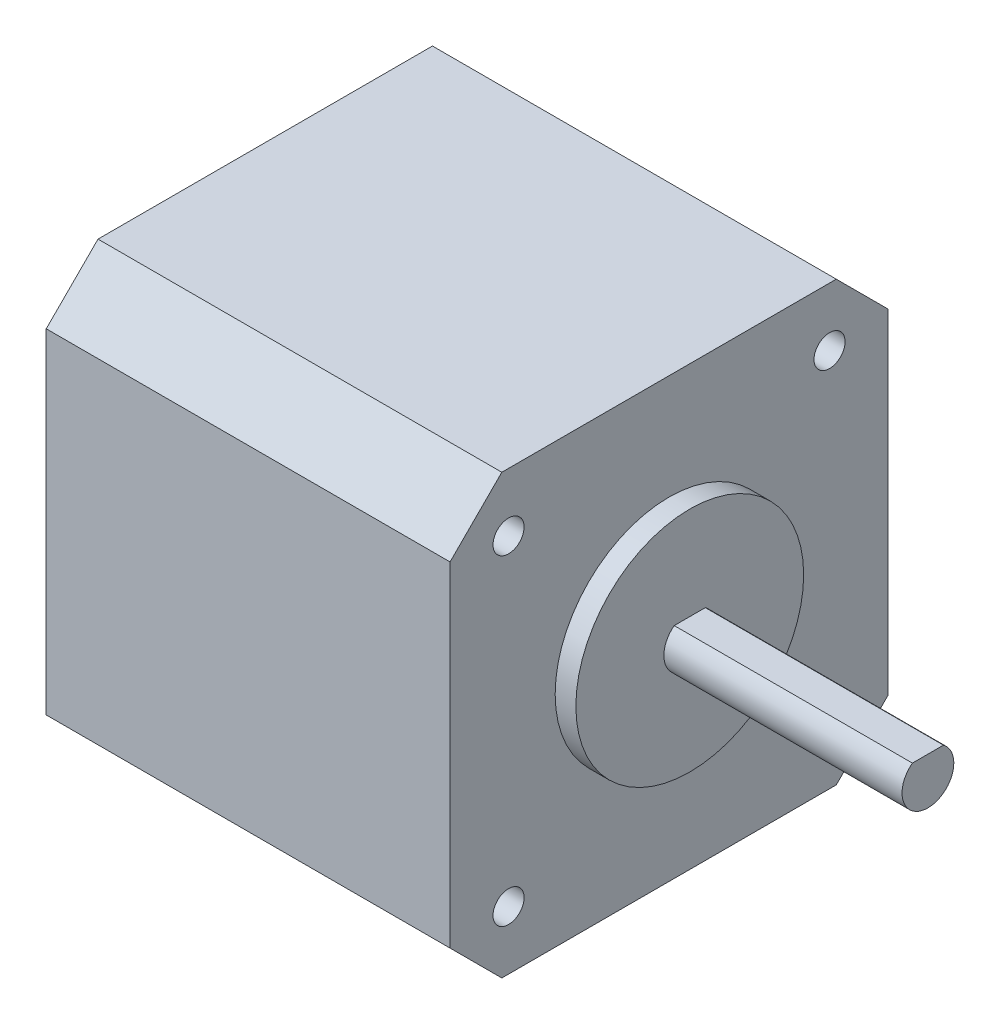
ISO-10303-21;
HEADER;
FILE_DESCRIPTION(('STEP AP214'),'2;1');
FILE_NAME('part.step','',(''),(''),'','','');
FILE_SCHEMA(('AUTOMOTIVE_DESIGN { 1 0 10303 214 1 1 1 1 }'));
ENDSEC;
DATA;
#1=APPLICATION_CONTEXT('core data for automotive mechanical design processes');
#2=APPLICATION_PROTOCOL_DEFINITION('international standard','automotive_design',2000,#1);
#3=PRODUCT_CONTEXT('',#1,'mechanical');
#4=PRODUCT('Part','Part','',(#3));
#5=PRODUCT_RELATED_PRODUCT_CATEGORY('part','',(#4));
#6=PRODUCT_DEFINITION_FORMATION('','',#4);
#7=PRODUCT_DEFINITION_CONTEXT('part definition',#1,'design');
#8=PRODUCT_DEFINITION('design','',#6,#7);
#9=PRODUCT_DEFINITION_SHAPE('','',#8);
#10=(LENGTH_UNIT() NAMED_UNIT(*) SI_UNIT(.MILLI.,.METRE.));
#11=(NAMED_UNIT(*) PLANE_ANGLE_UNIT() SI_UNIT($,.RADIAN.));
#12=(NAMED_UNIT(*) SI_UNIT($,.STERADIAN.) SOLID_ANGLE_UNIT());
#13=UNCERTAINTY_MEASURE_WITH_UNIT(LENGTH_MEASURE(1.E-05),#10,'distance_accuracy_value','');
#14=(GEOMETRIC_REPRESENTATION_CONTEXT(3) GLOBAL_UNCERTAINTY_ASSIGNED_CONTEXT((#13)) GLOBAL_UNIT_ASSIGNED_CONTEXT((#10,
#11,#12)) REPRESENTATION_CONTEXT('',''));
#15=CARTESIAN_POINT('',(0.,0.,0.));
#16=DIRECTION('',(0.,0.,1.));
#17=DIRECTION('',(1.,0.,0.));
#18=AXIS2_PLACEMENT_3D('',#15,#16,#17);
#19=CARTESIAN_POINT('',(39.,0.,-42.3));
#20=DIRECTION('',(0.,0.,1.));
#21=DIRECTION('',(1.,0.,0.));
#22=AXIS2_PLACEMENT_3D('',#19,#20,#21);
#23=PLANE('',#22);
#24=DIRECTION('',(0.,1.,0.));
#25=VECTOR('',#24,1.);
#26=CARTESIAN_POINT('',(0.,0.,-42.3));
#27=LINE('',#26,#25);
#28=CARTESIAN_POINT('',(0.,5.,-42.3));
#29=VERTEX_POINT('',#28);
#30=CARTESIAN_POINT('',(0.,37.3,-42.3));
#31=VERTEX_POINT('',#30);
#32=EDGE_CURVE('E172',#29,#31,#27,.T.);
#33=ORIENTED_EDGE('',*,*,#32,.T.);
#34=DIRECTION('',(-1.,0.,0.));
#35=VECTOR('',#34,1.);
#36=CARTESIAN_POINT('',(39.,37.3,-42.3));
#37=LINE('',#36,#35);
#38=CARTESIAN_POINT('',(39.,37.3,-42.3));
#39=VERTEX_POINT('',#38);
#40=EDGE_CURVE('E11',#39,#31,#37,.T.);
#41=ORIENTED_EDGE('',*,*,#40,.F.);
#42=DIRECTION('',(0.,1.,0.));
#43=VECTOR('',#42,1.);
#44=CARTESIAN_POINT('',(39.,0.,-42.3));
#45=LINE('',#44,#43);
#46=CARTESIAN_POINT('',(39.,5.,-42.3));
#47=VERTEX_POINT('',#46);
#48=EDGE_CURVE('E234',#47,#39,#45,.T.);
#49=ORIENTED_EDGE('',*,*,#48,.F.);
#50=DIRECTION('',(-1.,0.,0.));
#51=VECTOR('',#50,1.);
#52=CARTESIAN_POINT('',(39.,5.,-42.3));
#53=LINE('',#52,#51);
#54=EDGE_CURVE('E151',#47,#29,#53,.T.);
#55=ORIENTED_EDGE('',*,*,#54,.T.);
#56=EDGE_LOOP('',(#33,#41,#49,#55));
#57=FACE_BOUND('',#56,.T.);
#58=ADVANCED_FACE('F41',(#57),#23,.F.);
#59=CARTESIAN_POINT('',(39.,39.8,-39.8));
#60=DIRECTION('',(0.,-0.707106781186548,0.707106781186548));
#61=DIRECTION('',(0.,-0.707106781186548,-0.707106781186548));
#62=AXIS2_PLACEMENT_3D('',#59,#60,#61);
#63=PLANE('',#62);
#64=DIRECTION('',(0.,0.707106781186548,0.707106781186548));
#65=VECTOR('',#64,1.);
#66=CARTESIAN_POINT('',(0.,39.8,-39.8));
#67=LINE('',#66,#65);
#68=CARTESIAN_POINT('',(0.,42.3,-37.3));
#69=VERTEX_POINT('',#68);
#70=EDGE_CURVE('E176',#31,#69,#67,.T.);
#71=ORIENTED_EDGE('',*,*,#70,.T.);
#72=DIRECTION('',(-1.,0.,0.));
#73=VECTOR('',#72,1.);
#74=CARTESIAN_POINT('',(39.,42.3,-37.3));
#75=LINE('',#74,#73);
#76=CARTESIAN_POINT('',(39.,42.3,-37.3));
#77=VERTEX_POINT('',#76);
#78=EDGE_CURVE('E50',#77,#69,#75,.T.);
#79=ORIENTED_EDGE('',*,*,#78,.F.);
#80=DIRECTION('',(0.,0.707106781186548,0.707106781186548));
#81=VECTOR('',#80,1.);
#82=CARTESIAN_POINT('',(39.,39.8,-39.8));
#83=LINE('',#82,#81);
#84=EDGE_CURVE('E107',#39,#77,#83,.T.);
#85=ORIENTED_EDGE('',*,*,#84,.F.);
#86=ORIENTED_EDGE('',*,*,#40,.T.);
#87=EDGE_LOOP('',(#71,#79,#85,#86));
#88=FACE_BOUND('',#87,.T.);
#89=ADVANCED_FACE('F218',(#88),#63,.F.);
#90=CARTESIAN_POINT('',(39.,42.3,0.));
#91=DIRECTION('',(0.,1.,0.));
#92=DIRECTION('',(0.,0.,1.));
#93=AXIS2_PLACEMENT_3D('',#90,#91,#92);
#94=PLANE('',#93);
#95=DIRECTION('',(0.,0.,-1.));
#96=VECTOR('',#95,1.);
#97=CARTESIAN_POINT('',(0.,42.3,0.));
#98=LINE('',#97,#96);
#99=CARTESIAN_POINT('',(0.,42.3,-5.));
#100=VERTEX_POINT('',#99);
#101=EDGE_CURVE('E180',#100,#69,#98,.T.);
#102=ORIENTED_EDGE('',*,*,#101,.F.);
#103=DIRECTION('',(-1.,0.,0.));
#104=VECTOR('',#103,1.);
#105=CARTESIAN_POINT('',(39.,42.3,-5.));
#106=LINE('',#105,#104);
#107=CARTESIAN_POINT('',(39.,42.3,-5.));
#108=VERTEX_POINT('',#107);
#109=EDGE_CURVE('E209',#108,#100,#106,.T.);
#110=ORIENTED_EDGE('',*,*,#109,.F.);
#111=DIRECTION('',(0.,0.,-1.));
#112=VECTOR('',#111,1.);
#113=CARTESIAN_POINT('',(39.,42.3,0.));
#114=LINE('',#113,#112);
#115=EDGE_CURVE('E217',#108,#77,#114,.T.);
#116=ORIENTED_EDGE('',*,*,#115,.T.);
#117=ORIENTED_EDGE('',*,*,#78,.T.);
#118=EDGE_LOOP('',(#102,#110,#116,#117));
#119=FACE_BOUND('',#118,.T.);
#120=ADVANCED_FACE('F215',(#119),#94,.T.);
#121=CARTESIAN_POINT('',(39.,18.65,18.65));
#122=DIRECTION('',(0.,0.707106781186548,0.707106781186547));
#123=DIRECTION('',(0.,-0.707106781186547,0.707106781186548));
#124=AXIS2_PLACEMENT_3D('',#121,#122,#123);
#125=PLANE('',#124);
#126=DIRECTION('',(0.,0.707106781186547,-0.707106781186548));
#127=VECTOR('',#126,1.);
#128=CARTESIAN_POINT('',(0.,18.65,18.65));
#129=LINE('',#128,#127);
#130=CARTESIAN_POINT('',(0.,37.3,0.));
#131=VERTEX_POINT('',#130);
#132=EDGE_CURVE('E184',#131,#100,#129,.T.);
#133=ORIENTED_EDGE('',*,*,#132,.F.);
#134=DIRECTION('',(-1.,0.,0.));
#135=VECTOR('',#134,1.);
#136=CARTESIAN_POINT('',(39.,37.3,0.));
#137=LINE('',#136,#135);
#138=CARTESIAN_POINT('',(39.,37.3,0.));
#139=VERTEX_POINT('',#138);
#140=EDGE_CURVE('E206',#139,#131,#137,.T.);
#141=ORIENTED_EDGE('',*,*,#140,.F.);
#142=DIRECTION('',(0.,0.707106781186547,-0.707106781186548));
#143=VECTOR('',#142,1.);
#144=CARTESIAN_POINT('',(39.,18.65,18.65));
#145=LINE('',#144,#143);
#146=EDGE_CURVE('E228',#139,#108,#145,.T.);
#147=ORIENTED_EDGE('',*,*,#146,.T.);
#148=ORIENTED_EDGE('',*,*,#109,.T.);
#149=EDGE_LOOP('',(#133,#141,#147,#148));
#150=FACE_BOUND('',#149,.T.);
#151=ADVANCED_FACE('F226',(#150),#125,.T.);
#152=CARTESIAN_POINT('',(39.,0.,0.));
#153=DIRECTION('',(0.,0.,1.));
#154=DIRECTION('',(1.,0.,0.));
#155=AXIS2_PLACEMENT_3D('',#152,#153,#154);
#156=PLANE('',#155);
#157=DIRECTION('',(0.,1.,0.));
#158=VECTOR('',#157,1.);
#159=CARTESIAN_POINT('',(0.,0.,0.));
#160=LINE('',#159,#158);
#161=CARTESIAN_POINT('',(0.,5.,0.));
#162=VERTEX_POINT('',#161);
#163=EDGE_CURVE('E188',#162,#131,#160,.T.);
#164=ORIENTED_EDGE('',*,*,#163,.F.);
#165=DIRECTION('',(-1.,0.,0.));
#166=VECTOR('',#165,1.);
#167=CARTESIAN_POINT('',(39.,5.,0.));
#168=LINE('',#167,#166);
#169=CARTESIAN_POINT('',(39.,5.,0.));
#170=VERTEX_POINT('',#169);
#171=EDGE_CURVE('E144',#170,#162,#168,.T.);
#172=ORIENTED_EDGE('',*,*,#171,.F.);
#173=DIRECTION('',(0.,1.,0.));
#174=VECTOR('',#173,1.);
#175=CARTESIAN_POINT('',(39.,0.,0.));
#176=LINE('',#175,#174);
#177=EDGE_CURVE('E132',#170,#139,#176,.T.);
#178=ORIENTED_EDGE('',*,*,#177,.T.);
#179=ORIENTED_EDGE('',*,*,#140,.T.);
#180=EDGE_LOOP('',(#164,#172,#178,#179));
#181=FACE_BOUND('',#180,.T.);
#182=ADVANCED_FACE('F239',(#181),#156,.T.);
#183=CARTESIAN_POINT('',(39.,2.5,-2.5));
#184=DIRECTION('',(0.,0.707106781186548,-0.707106781186548));
#185=DIRECTION('',(0.,0.707106781186548,0.707106781186548));
#186=AXIS2_PLACEMENT_3D('',#183,#184,#185);
#187=PLANE('',#186);
#188=DIRECTION('',(0.,-0.707106781186548,-0.707106781186548));
#189=VECTOR('',#188,1.);
#190=CARTESIAN_POINT('',(0.,2.5,-2.5));
#191=LINE('',#190,#189);
#192=CARTESIAN_POINT('',(0.,0.,-5.));
#193=VERTEX_POINT('',#192);
#194=EDGE_CURVE('E140',#162,#193,#191,.T.);
#195=ORIENTED_EDGE('',*,*,#194,.T.);
#196=DIRECTION('',(-1.,0.,0.));
#197=VECTOR('',#196,1.);
#198=CARTESIAN_POINT('',(39.,0.,-5.));
#199=LINE('',#198,#197);
#200=CARTESIAN_POINT('',(39.,0.,-5.));
#201=VERTEX_POINT('',#200);
#202=EDGE_CURVE('E137',#201,#193,#199,.T.);
#203=ORIENTED_EDGE('',*,*,#202,.F.);
#204=DIRECTION('',(0.,-0.707106781186548,-0.707106781186548));
#205=VECTOR('',#204,1.);
#206=CARTESIAN_POINT('',(39.,2.5,-2.5));
#207=LINE('',#206,#205);
#208=EDGE_CURVE('E124',#170,#201,#207,.T.);
#209=ORIENTED_EDGE('',*,*,#208,.F.);
#210=ORIENTED_EDGE('',*,*,#171,.T.);
#211=EDGE_LOOP('',(#195,#203,#209,#210));
#212=FACE_BOUND('',#211,.T.);
#213=ADVANCED_FACE('F138',(#212),#187,.F.);
#214=CARTESIAN_POINT('',(39.,0.,0.));
#215=DIRECTION('',(0.,1.,0.));
#216=DIRECTION('',(0.,0.,1.));
#217=AXIS2_PLACEMENT_3D('',#214,#215,#216);
#218=PLANE('',#217);
#219=DIRECTION('',(0.,0.,-1.));
#220=VECTOR('',#219,1.);
#221=CARTESIAN_POINT('',(0.,0.,0.));
#222=LINE('',#221,#220);
#223=CARTESIAN_POINT('',(0.,0.,-37.3));
#224=VERTEX_POINT('',#223);
#225=EDGE_CURVE('E194',#193,#224,#222,.T.);
#226=ORIENTED_EDGE('',*,*,#225,.T.);
#227=DIRECTION('',(-1.,0.,0.));
#228=VECTOR('',#227,1.);
#229=CARTESIAN_POINT('',(39.,0.,-37.3));
#230=LINE('',#229,#228);
#231=CARTESIAN_POINT('',(39.,0.,-37.3));
#232=VERTEX_POINT('',#231);
#233=EDGE_CURVE('E145',#232,#224,#230,.T.);
#234=ORIENTED_EDGE('',*,*,#233,.F.);
#235=DIRECTION('',(0.,0.,-1.));
#236=VECTOR('',#235,1.);
#237=CARTESIAN_POINT('',(39.,0.,0.));
#238=LINE('',#237,#236);
#239=EDGE_CURVE('E128',#201,#232,#238,.T.);
#240=ORIENTED_EDGE('',*,*,#239,.F.);
#241=ORIENTED_EDGE('',*,*,#202,.T.);
#242=EDGE_LOOP('',(#226,#234,#240,#241));
#243=FACE_BOUND('',#242,.T.);
#244=ADVANCED_FACE('F147',(#243),#218,.F.);
#245=CARTESIAN_POINT('',(39.,36.65,-5.65));
#246=DIRECTION('',(-1.,0.,0.));
#247=DIRECTION('',(0.,0.,1.));
#248=AXIS2_PLACEMENT_3D('',#245,#246,#247);
#249=CYLINDRICAL_SURFACE('',#248,1.5);
#250=CARTESIAN_POINT('',(39.,36.65,-5.65));
#251=DIRECTION('',(1.,0.,0.));
#252=DIRECTION('',(0.,0.,-1.));
#253=AXIS2_PLACEMENT_3D('',#250,#251,#252);
#254=CIRCLE('',#253,1.5);
#255=CARTESIAN_POINT('',(39.,36.65,-7.15));
#256=VERTEX_POINT('',#255);
#257=EDGE_CURVE('E244',#256,#256,#254,.T.);
#258=ORIENTED_EDGE('',*,*,#257,.T.);
#259=EDGE_LOOP('',(#258));
#260=FACE_BOUND('',#259,.T.);
#261=CARTESIAN_POINT('',(0.,36.65,-5.65));
#262=DIRECTION('',(1.,0.,0.));
#263=DIRECTION('',(0.,0.,-1.));
#264=AXIS2_PLACEMENT_3D('',#261,#262,#263);
#265=CIRCLE('',#264,1.5);
#266=CARTESIAN_POINT('',(0.,36.65,-7.15));
#267=VERTEX_POINT('',#266);
#268=EDGE_CURVE('E168',#267,#267,#265,.T.);
#269=ORIENTED_EDGE('',*,*,#268,.F.);
#270=EDGE_LOOP('',(#269));
#271=FACE_BOUND('',#270,.T.);
#272=ADVANCED_FACE('F321',(#260,#271),#249,.F.);
#273=CARTESIAN_POINT('',(39.,36.65,-36.65));
#274=DIRECTION('',(-1.,0.,0.));
#275=DIRECTION('',(0.,0.,1.));
#276=AXIS2_PLACEMENT_3D('',#273,#274,#275);
#277=CYLINDRICAL_SURFACE('',#276,1.5);
#278=CARTESIAN_POINT('',(39.,36.65,-36.65));
#279=DIRECTION('',(1.,0.,0.));
#280=DIRECTION('',(0.,0.,-1.));
#281=AXIS2_PLACEMENT_3D('',#278,#279,#280);
#282=CIRCLE('',#281,1.5);
#283=CARTESIAN_POINT('',(39.,36.65,-38.15));
#284=VERTEX_POINT('',#283);
#285=EDGE_CURVE('E247',#284,#284,#282,.T.);
#286=ORIENTED_EDGE('',*,*,#285,.T.);
#287=EDGE_LOOP('',(#286));
#288=FACE_BOUND('',#287,.T.);
#289=CARTESIAN_POINT('',(0.,36.65,-36.65));
#290=DIRECTION('',(1.,0.,0.));
#291=DIRECTION('',(0.,0.,-1.));
#292=AXIS2_PLACEMENT_3D('',#289,#290,#291);
#293=CIRCLE('',#292,1.5);
#294=CARTESIAN_POINT('',(0.,36.65,-38.15));
#295=VERTEX_POINT('',#294);
#296=EDGE_CURVE('E164',#295,#295,#293,.T.);
#297=ORIENTED_EDGE('',*,*,#296,.F.);
#298=EDGE_LOOP('',(#297));
#299=FACE_BOUND('',#298,.T.);
#300=ADVANCED_FACE('F324',(#288,#299),#277,.F.);
#301=CARTESIAN_POINT('',(39.,5.65,-36.65));
#302=DIRECTION('',(-1.,0.,0.));
#303=DIRECTION('',(0.,0.,1.));
#304=AXIS2_PLACEMENT_3D('',#301,#302,#303);
#305=CYLINDRICAL_SURFACE('',#304,1.5);
#306=CARTESIAN_POINT('',(39.,5.65,-36.65));
#307=DIRECTION('',(1.,0.,0.));
#308=DIRECTION('',(0.,0.,-1.));
#309=AXIS2_PLACEMENT_3D('',#306,#307,#308);
#310=CIRCLE('',#309,1.5);
#311=CARTESIAN_POINT('',(39.,5.65,-38.15));
#312=VERTEX_POINT('',#311);
#313=EDGE_CURVE('E253',#312,#312,#310,.T.);
#314=ORIENTED_EDGE('',*,*,#313,.T.);
#315=EDGE_LOOP('',(#314));
#316=FACE_BOUND('',#315,.T.);
#317=CARTESIAN_POINT('',(0.,5.65,-36.65));
#318=DIRECTION('',(1.,0.,0.));
#319=DIRECTION('',(0.,0.,-1.));
#320=AXIS2_PLACEMENT_3D('',#317,#318,#319);
#321=CIRCLE('',#320,1.5);
#322=CARTESIAN_POINT('',(0.,5.65,-38.15));
#323=VERTEX_POINT('',#322);
#324=EDGE_CURVE('E159',#323,#323,#321,.T.);
#325=ORIENTED_EDGE('',*,*,#324,.F.);
#326=EDGE_LOOP('',(#325));
#327=FACE_BOUND('',#326,.T.);
#328=ADVANCED_FACE('F344',(#316,#327),#305,.F.);
#329=CARTESIAN_POINT('',(39.,5.65,-5.65));
#330=DIRECTION('',(-1.,0.,0.));
#331=DIRECTION('',(0.,0.,1.));
#332=AXIS2_PLACEMENT_3D('',#329,#330,#331);
#333=CYLINDRICAL_SURFACE('',#332,1.5);
#334=CARTESIAN_POINT('',(39.,5.65,-5.65));
#335=DIRECTION('',(1.,0.,0.));
#336=DIRECTION('',(0.,0.,-1.));
#337=AXIS2_PLACEMENT_3D('',#334,#335,#336);
#338=CIRCLE('',#337,1.5);
#339=CARTESIAN_POINT('',(39.,5.65,-7.15));
#340=VERTEX_POINT('',#339);
#341=EDGE_CURVE('E199',#340,#340,#338,.T.);
#342=ORIENTED_EDGE('',*,*,#341,.T.);
#343=EDGE_LOOP('',(#342));
#344=FACE_BOUND('',#343,.T.);
#345=CARTESIAN_POINT('',(0.,5.65,-5.65));
#346=DIRECTION('',(1.,0.,0.));
#347=DIRECTION('',(0.,0.,-1.));
#348=AXIS2_PLACEMENT_3D('',#345,#346,#347);
#349=CIRCLE('',#348,1.5);
#350=CARTESIAN_POINT('',(0.,5.65,-7.15));
#351=VERTEX_POINT('',#350);
#352=EDGE_CURVE('E155',#351,#351,#349,.T.);
#353=ORIENTED_EDGE('',*,*,#352,.F.);
#354=EDGE_LOOP('',(#353));
#355=FACE_BOUND('',#354,.T.);
#356=ADVANCED_FACE('F43',(#344,#355),#333,.F.);
#357=CARTESIAN_POINT('',(39.,-18.65,-18.65));
#358=DIRECTION('',(0.,0.707106781186547,0.707106781186548));
#359=DIRECTION('',(0.,-0.707106781186548,0.707106781186547));
#360=AXIS2_PLACEMENT_3D('',#357,#358,#359);
#361=PLANE('',#360);
#362=DIRECTION('',(0.,0.707106781186548,-0.707106781186547));
#363=VECTOR('',#362,1.);
#364=CARTESIAN_POINT('',(0.,-18.65,-18.65));
#365=LINE('',#364,#363);
#366=EDGE_CURVE('E99',#224,#29,#365,.T.);
#367=ORIENTED_EDGE('',*,*,#366,.T.);
#368=ORIENTED_EDGE('',*,*,#54,.F.);
#369=DIRECTION('',(0.,0.707106781186548,-0.707106781186547));
#370=VECTOR('',#369,1.);
#371=CARTESIAN_POINT('',(39.,-18.65,-18.65));
#372=LINE('',#371,#370);
#373=EDGE_CURVE('E66',#232,#47,#372,.T.);
#374=ORIENTED_EDGE('',*,*,#373,.F.);
#375=ORIENTED_EDGE('',*,*,#233,.T.);
#376=EDGE_LOOP('',(#367,#368,#374,#375));
#377=FACE_BOUND('',#376,.T.);
#378=ADVANCED_FACE('F240',(#377),#361,.F.);
#379=CARTESIAN_POINT('',(39.,0.,0.));
#380=DIRECTION('',(1.,0.,0.));
#381=DIRECTION('',(0.,0.,-1.));
#382=AXIS2_PLACEMENT_3D('',#379,#380,#381);
#383=PLANE('',#382);
#384=CARTESIAN_POINT('',(39.,21.15,-21.15));
#385=DIRECTION('',(1.,0.,0.));
#386=DIRECTION('',(0.,0.,-1.));
#387=AXIS2_PLACEMENT_3D('',#384,#385,#386);
#388=CIRCLE('',#387,11.);
#389=CARTESIAN_POINT('',(39.,21.15,-32.15));
#390=VERTEX_POINT('',#389);
#391=EDGE_CURVE('E260',#390,#390,#388,.T.);
#392=ORIENTED_EDGE('',*,*,#391,.F.);
#393=EDGE_LOOP('',(#392));
#394=FACE_BOUND('',#393,.T.);
#395=ORIENTED_EDGE('',*,*,#341,.F.);
#396=EDGE_LOOP('',(#395));
#397=FACE_BOUND('',#396,.T.);
#398=ORIENTED_EDGE('',*,*,#313,.F.);
#399=EDGE_LOOP('',(#398));
#400=FACE_BOUND('',#399,.T.);
#401=ORIENTED_EDGE('',*,*,#285,.F.);
#402=EDGE_LOOP('',(#401));
#403=FACE_BOUND('',#402,.T.);
#404=ORIENTED_EDGE('',*,*,#257,.F.);
#405=EDGE_LOOP('',(#404));
#406=FACE_BOUND('',#405,.T.);
#407=ORIENTED_EDGE('',*,*,#48,.T.);
#408=ORIENTED_EDGE('',*,*,#84,.T.);
#409=ORIENTED_EDGE('',*,*,#115,.F.);
#410=ORIENTED_EDGE('',*,*,#146,.F.);
#411=ORIENTED_EDGE('',*,*,#177,.F.);
#412=ORIENTED_EDGE('',*,*,#208,.T.);
#413=ORIENTED_EDGE('',*,*,#239,.T.);
#414=ORIENTED_EDGE('',*,*,#373,.T.);
#415=EDGE_LOOP('',(#407,#408,#409,#410,#411,#412,#413,#414));
#416=FACE_BOUND('',#415,.T.);
#417=ADVANCED_FACE('F126',(#394,#397,#400,#403,#406,#416),#383,.T.);
#418=CARTESIAN_POINT('',(0.,0.,0.));
#419=DIRECTION('',(1.,0.,0.));
#420=DIRECTION('',(0.,0.,-1.));
#421=AXIS2_PLACEMENT_3D('',#418,#419,#420);
#422=PLANE('',#421);
#423=ORIENTED_EDGE('',*,*,#352,.T.);
#424=EDGE_LOOP('',(#423));
#425=FACE_BOUND('',#424,.T.);
#426=ORIENTED_EDGE('',*,*,#324,.T.);
#427=EDGE_LOOP('',(#426));
#428=FACE_BOUND('',#427,.T.);
#429=ORIENTED_EDGE('',*,*,#296,.T.);
#430=EDGE_LOOP('',(#429));
#431=FACE_BOUND('',#430,.T.);
#432=ORIENTED_EDGE('',*,*,#268,.T.);
#433=EDGE_LOOP('',(#432));
#434=FACE_BOUND('',#433,.T.);
#435=ORIENTED_EDGE('',*,*,#32,.F.);
#436=ORIENTED_EDGE('',*,*,#366,.F.);
#437=ORIENTED_EDGE('',*,*,#225,.F.);
#438=ORIENTED_EDGE('',*,*,#194,.F.);
#439=ORIENTED_EDGE('',*,*,#163,.T.);
#440=ORIENTED_EDGE('',*,*,#132,.T.);
#441=ORIENTED_EDGE('',*,*,#101,.T.);
#442=ORIENTED_EDGE('',*,*,#70,.F.);
#443=EDGE_LOOP('',(#435,#436,#437,#438,#439,#440,#441,#442));
#444=FACE_BOUND('',#443,.T.);
#445=ADVANCED_FACE('F222',(#425,#428,#431,#434,#444),#422,.F.);
#446=CARTESIAN_POINT('',(41.,21.15,-21.15));
#447=DIRECTION('',(-1.,0.,0.));
#448=DIRECTION('',(0.,0.,1.));
#449=AXIS2_PLACEMENT_3D('',#446,#447,#448);
#450=CYLINDRICAL_SURFACE('',#449,11.);
#451=CARTESIAN_POINT('',(41.,21.15,-21.15));
#452=DIRECTION('',(1.,0.,0.));
#453=DIRECTION('',(0.,0.,-1.));
#454=AXIS2_PLACEMENT_3D('',#451,#452,#453);
#455=CIRCLE('',#454,11.);
#456=CARTESIAN_POINT('',(41.,21.15,-32.15));
#457=VERTEX_POINT('',#456);
#458=EDGE_CURVE('E160',#457,#457,#455,.T.);
#459=ORIENTED_EDGE('',*,*,#458,.F.);
#460=EDGE_LOOP('',(#459));
#461=FACE_BOUND('',#460,.T.);
#462=ORIENTED_EDGE('',*,*,#391,.T.);
#463=EDGE_LOOP('',(#462));
#464=FACE_BOUND('',#463,.T.);
#465=ADVANCED_FACE('F301',(#461,#464),#450,.T.);
#466=CARTESIAN_POINT('',(41.,21.15,-21.15));
#467=DIRECTION('',(1.,0.,0.));
#468=DIRECTION('',(0.,0.,-1.));
#469=AXIS2_PLACEMENT_3D('',#466,#467,#468);
#470=PLANE('',#469);
#471=CARTESIAN_POINT('',(41.,21.15,-21.15));
#472=DIRECTION('',(1.,0.,0.));
#473=DIRECTION('',(0.,0.,-1.));
#474=AXIS2_PLACEMENT_3D('',#471,#472,#473);
#475=CIRCLE('',#474,2.5);
#476=CARTESIAN_POINT('',(41.,23.15,-19.65));
#477=VERTEX_POINT('',#476);
#478=CARTESIAN_POINT('',(41.,23.15,-22.65));
#479=VERTEX_POINT('',#478);
#480=EDGE_CURVE('E57',#477,#479,#475,.T.);
#481=ORIENTED_EDGE('',*,*,#480,.F.);
#482=DIRECTION('',(0.,0.,-1.));
#483=VECTOR('',#482,1.);
#484=CARTESIAN_POINT('',(41.,23.15,-19.65));
#485=LINE('',#484,#483);
#486=EDGE_CURVE('E274',#477,#479,#485,.T.);
#487=ORIENTED_EDGE('',*,*,#486,.T.);
#488=EDGE_LOOP('',(#481,#487));
#489=FACE_BOUND('',#488,.T.);
#490=ORIENTED_EDGE('',*,*,#458,.T.);
#491=EDGE_LOOP('',(#490));
#492=FACE_BOUND('',#491,.T.);
#493=ADVANCED_FACE('F298',(#489,#492),#470,.T.);
#494=CARTESIAN_POINT('',(64.,21.15,-21.15));
#495=DIRECTION('',(-1.,0.,0.));
#496=DIRECTION('',(0.,0.,1.));
#497=AXIS2_PLACEMENT_3D('',#494,#495,#496);
#498=CYLINDRICAL_SURFACE('',#497,2.5);
#499=ORIENTED_EDGE('',*,*,#480,.T.);
#500=DIRECTION('',(-1.,0.,0.));
#501=VECTOR('',#500,1.);
#502=CARTESIAN_POINT('',(64.,23.15,-22.65));
#503=LINE('',#502,#501);
#504=CARTESIAN_POINT('',(64.,23.15,-22.65));
#505=VERTEX_POINT('',#504);
#506=EDGE_CURVE('E264',#505,#479,#503,.T.);
#507=ORIENTED_EDGE('',*,*,#506,.F.);
#508=CARTESIAN_POINT('',(64.,21.15,-21.15));
#509=DIRECTION('',(1.,0.,0.));
#510=DIRECTION('',(0.,0.,-1.));
#511=AXIS2_PLACEMENT_3D('',#508,#509,#510);
#512=CIRCLE('',#511,2.5);
#513=CARTESIAN_POINT('',(64.,23.15,-19.65));
#514=VERTEX_POINT('',#513);
#515=EDGE_CURVE('E278',#514,#505,#512,.T.);
#516=ORIENTED_EDGE('',*,*,#515,.F.);
#517=DIRECTION('',(-1.,0.,0.));
#518=VECTOR('',#517,1.);
#519=CARTESIAN_POINT('',(64.,23.15,-19.65));
#520=LINE('',#519,#518);
#521=EDGE_CURVE('E270',#514,#477,#520,.T.);
#522=ORIENTED_EDGE('',*,*,#521,.T.);
#523=EDGE_LOOP('',(#499,#507,#516,#522));
#524=FACE_BOUND('',#523,.T.);
#525=ADVANCED_FACE('F292',(#524),#498,.T.);
#526=CARTESIAN_POINT('',(64.,23.15,-19.65));
#527=DIRECTION('',(0.,1.,0.));
#528=DIRECTION('',(0.,0.,1.));
#529=AXIS2_PLACEMENT_3D('',#526,#527,#528);
#530=PLANE('',#529);
#531=ORIENTED_EDGE('',*,*,#486,.F.);
#532=ORIENTED_EDGE('',*,*,#521,.F.);
#533=DIRECTION('',(0.,0.,-1.));
#534=VECTOR('',#533,1.);
#535=CARTESIAN_POINT('',(64.,23.15,-19.65));
#536=LINE('',#535,#534);
#537=EDGE_CURVE('E273',#514,#505,#536,.T.);
#538=ORIENTED_EDGE('',*,*,#537,.T.);
#539=ORIENTED_EDGE('',*,*,#506,.T.);
#540=EDGE_LOOP('',(#531,#532,#538,#539));
#541=FACE_BOUND('',#540,.T.);
#542=ADVANCED_FACE('F296',(#541),#530,.T.);
#543=CARTESIAN_POINT('',(64.,21.15,-21.15));
#544=DIRECTION('',(1.,0.,0.));
#545=DIRECTION('',(0.,0.,-1.));
#546=AXIS2_PLACEMENT_3D('',#543,#544,#545);
#547=PLANE('',#546);
#548=ORIENTED_EDGE('',*,*,#515,.T.);
#549=ORIENTED_EDGE('',*,*,#537,.F.);
#550=EDGE_LOOP('',(#548,#549));
#551=FACE_BOUND('',#550,.T.);
#552=ADVANCED_FACE('F290',(#551),#547,.T.);
#553=CLOSED_SHELL('',(#58,#89,#120,#151,#182,#213,#244,#272,#300,#328,#356,#378,#417,#445,#465,
#493,#525,#542,#552));
#554=MANIFOLD_SOLID_BREP('B2',#553);
#555=ADVANCED_BREP_SHAPE_REPRESENTATION('',(#18,#554),#14);
#556=SHAPE_DEFINITION_REPRESENTATION(#9,#555);
ENDSEC;
END-ISO-10303-21;
